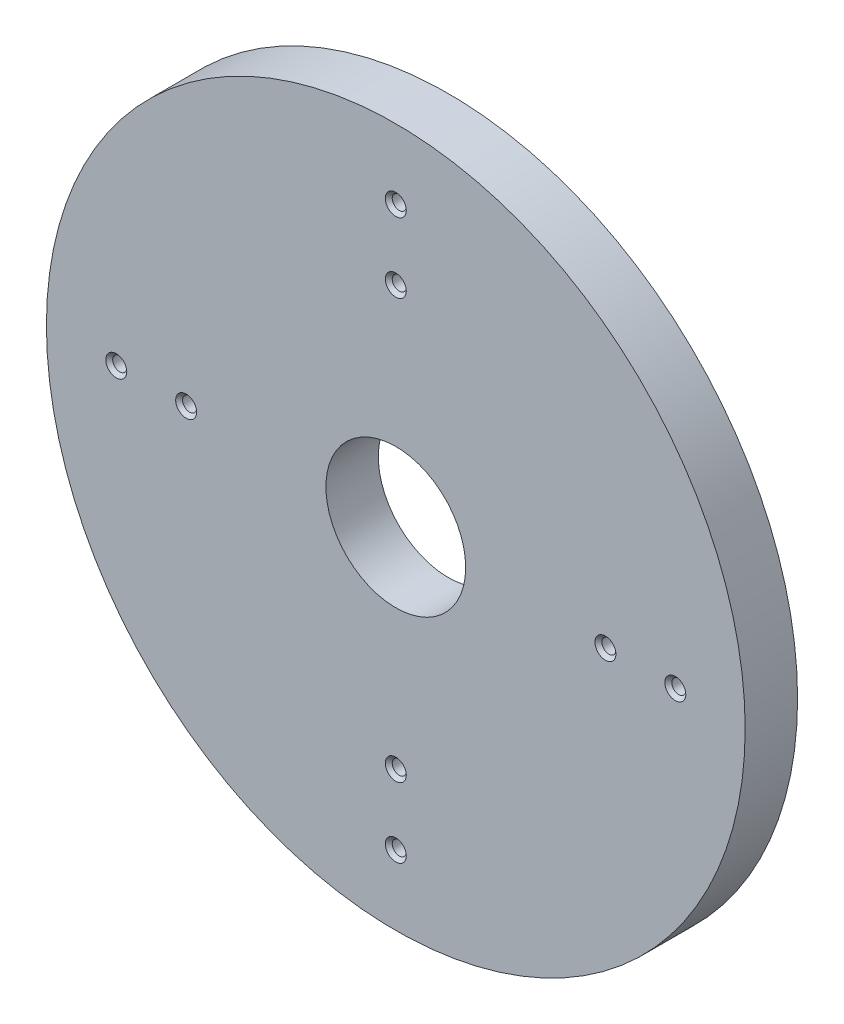
ISO-10303-21;
HEADER;
FILE_DESCRIPTION(('STEP AP214'),'2;1');
FILE_NAME('part.step','',(''),(''),'','','');
FILE_SCHEMA(('AUTOMOTIVE_DESIGN { 1 0 10303 214 1 1 1 1 }'));
ENDSEC;
DATA;
#1=APPLICATION_CONTEXT('core data for automotive mechanical design processes');
#2=APPLICATION_PROTOCOL_DEFINITION('international standard','automotive_design',2000,#1);
#3=PRODUCT_CONTEXT('',#1,'mechanical');
#4=PRODUCT('Part','Part','',(#3));
#5=PRODUCT_RELATED_PRODUCT_CATEGORY('part','',(#4));
#6=PRODUCT_DEFINITION_FORMATION('','',#4);
#7=PRODUCT_DEFINITION_CONTEXT('part definition',#1,'design');
#8=PRODUCT_DEFINITION('design','',#6,#7);
#9=PRODUCT_DEFINITION_SHAPE('','',#8);
#10=(LENGTH_UNIT() NAMED_UNIT(*) SI_UNIT(.MILLI.,.METRE.));
#11=(NAMED_UNIT(*) PLANE_ANGLE_UNIT() SI_UNIT($,.RADIAN.));
#12=(NAMED_UNIT(*) SI_UNIT($,.STERADIAN.) SOLID_ANGLE_UNIT());
#13=UNCERTAINTY_MEASURE_WITH_UNIT(LENGTH_MEASURE(1.E-05),#10,'distance_accuracy_value','');
#14=(GEOMETRIC_REPRESENTATION_CONTEXT(3) GLOBAL_UNCERTAINTY_ASSIGNED_CONTEXT((#13)) GLOBAL_UNIT_ASSIGNED_CONTEXT((#10,
#11,#12)) REPRESENTATION_CONTEXT('',''));
#15=CARTESIAN_POINT('',(0.,0.,0.));
#16=DIRECTION('',(0.,0.,1.));
#17=DIRECTION('',(1.,0.,0.));
#18=AXIS2_PLACEMENT_3D('',#15,#16,#17);
#19=CARTESIAN_POINT('',(0.,0.,19.05));
#20=DIRECTION('',(0.,0.,-1.));
#21=DIRECTION('',(-1.,0.,0.));
#22=AXIS2_PLACEMENT_3D('',#19,#20,#21);
#23=CYLINDRICAL_SURFACE('',#22,25.4);
#24=CARTESIAN_POINT('',(0.,0.,19.05));
#25=DIRECTION('',(0.,0.,1.));
#26=DIRECTION('',(1.,0.,0.));
#27=AXIS2_PLACEMENT_3D('',#24,#25,#26);
#28=CIRCLE('',#27,25.4);
#29=CARTESIAN_POINT('',(25.4,0.,19.05));
#30=VERTEX_POINT('',#29);
#31=EDGE_CURVE('E43',#30,#30,#28,.T.);
#32=ORIENTED_EDGE('',*,*,#31,.T.);
#33=EDGE_LOOP('',(#32));
#34=FACE_BOUND('',#33,.T.);
#35=CARTESIAN_POINT('',(0.,0.,0.));
#36=DIRECTION('',(0.,0.,1.));
#37=DIRECTION('',(1.,0.,0.));
#38=AXIS2_PLACEMENT_3D('',#35,#36,#37);
#39=CIRCLE('',#38,25.4);
#40=CARTESIAN_POINT('',(25.4,0.,0.));
#41=VERTEX_POINT('',#40);
#42=EDGE_CURVE('E50',#41,#41,#39,.T.);
#43=ORIENTED_EDGE('',*,*,#42,.F.);
#44=EDGE_LOOP('',(#43));
#45=FACE_BOUND('',#44,.T.);
#46=ADVANCED_FACE('F36',(#34,#45),#23,.F.);
#47=CARTESIAN_POINT('',(0.,0.,19.05));
#48=DIRECTION('',(0.,0.,-1.));
#49=DIRECTION('',(-1.,0.,0.));
#50=AXIS2_PLACEMENT_3D('',#47,#48,#49);
#51=CYLINDRICAL_SURFACE('',#50,127.);
#52=CARTESIAN_POINT('',(0.,0.,19.05));
#53=DIRECTION('',(0.,0.,1.));
#54=DIRECTION('',(1.,0.,0.));
#55=AXIS2_PLACEMENT_3D('',#52,#53,#54);
#56=CIRCLE('',#55,127.);
#57=CARTESIAN_POINT('',(127.,0.,19.05));
#58=VERTEX_POINT('',#57);
#59=EDGE_CURVE('E10',#58,#58,#56,.T.);
#60=ORIENTED_EDGE('',*,*,#59,.F.);
#61=EDGE_LOOP('',(#60));
#62=FACE_BOUND('',#61,.T.);
#63=CARTESIAN_POINT('',(0.,0.,0.));
#64=DIRECTION('',(0.,0.,1.));
#65=DIRECTION('',(1.,0.,0.));
#66=AXIS2_PLACEMENT_3D('',#63,#64,#65);
#67=CIRCLE('',#66,127.);
#68=CARTESIAN_POINT('',(127.,0.,0.));
#69=VERTEX_POINT('',#68);
#70=EDGE_CURVE('E39',#69,#69,#67,.T.);
#71=ORIENTED_EDGE('',*,*,#70,.T.);
#72=EDGE_LOOP('',(#71));
#73=FACE_BOUND('',#72,.T.);
#74=ADVANCED_FACE('F179',(#62,#73),#51,.T.);
#75=CARTESIAN_POINT('',(0.,0.,19.05));
#76=DIRECTION('',(0.,0.,1.));
#77=DIRECTION('',(1.,0.,0.));
#78=AXIS2_PLACEMENT_3D('',#75,#76,#77);
#79=PLANE('',#78);
#80=CARTESIAN_POINT('',(0.,101.6,19.05));
#81=DIRECTION('',(0.,0.,1.));
#82=DIRECTION('',(1.,0.,0.));
#83=AXIS2_PLACEMENT_3D('',#80,#81,#82);
#84=CIRCLE('',#83,3.81);
#85=CARTESIAN_POINT('',(3.81,101.6,19.05));
#86=VERTEX_POINT('',#85);
#87=EDGE_CURVE('E147',#86,#86,#84,.T.);
#88=ORIENTED_EDGE('',*,*,#87,.F.);
#89=EDGE_LOOP('',(#88));
#90=FACE_BOUND('',#89,.T.);
#91=CARTESIAN_POINT('',(0.,76.2,19.05));
#92=DIRECTION('',(0.,0.,1.));
#93=DIRECTION('',(1.,0.,0.));
#94=AXIS2_PLACEMENT_3D('',#91,#92,#93);
#95=CIRCLE('',#94,3.81);
#96=CARTESIAN_POINT('',(3.81,76.2,19.05));
#97=VERTEX_POINT('',#96);
#98=EDGE_CURVE('E135',#97,#97,#95,.T.);
#99=ORIENTED_EDGE('',*,*,#98,.F.);
#100=EDGE_LOOP('',(#99));
#101=FACE_BOUND('',#100,.T.);
#102=CARTESIAN_POINT('',(101.6,0.,19.05));
#103=DIRECTION('',(0.,0.,1.));
#104=DIRECTION('',(1.,0.,0.));
#105=AXIS2_PLACEMENT_3D('',#102,#103,#104);
#106=CIRCLE('',#105,3.80999999999999);
#107=CARTESIAN_POINT('',(105.41,0.,19.05));
#108=VERTEX_POINT('',#107);
#109=EDGE_CURVE('E123',#108,#108,#106,.T.);
#110=ORIENTED_EDGE('',*,*,#109,.F.);
#111=EDGE_LOOP('',(#110));
#112=FACE_BOUND('',#111,.T.);
#113=CARTESIAN_POINT('',(76.2,0.,19.05));
#114=DIRECTION('',(0.,0.,1.));
#115=DIRECTION('',(1.,0.,0.));
#116=AXIS2_PLACEMENT_3D('',#113,#114,#115);
#117=CIRCLE('',#116,3.80999999999999);
#118=CARTESIAN_POINT('',(80.01,0.,19.05));
#119=VERTEX_POINT('',#118);
#120=EDGE_CURVE('E111',#119,#119,#117,.T.);
#121=ORIENTED_EDGE('',*,*,#120,.F.);
#122=EDGE_LOOP('',(#121));
#123=FACE_BOUND('',#122,.T.);
#124=CARTESIAN_POINT('',(0.,-101.6,19.05));
#125=DIRECTION('',(0.,0.,1.));
#126=DIRECTION('',(1.,0.,0.));
#127=AXIS2_PLACEMENT_3D('',#124,#125,#126);
#128=CIRCLE('',#127,3.81);
#129=CARTESIAN_POINT('',(3.81,-101.6,19.05));
#130=VERTEX_POINT('',#129);
#131=EDGE_CURVE('E99',#130,#130,#128,.T.);
#132=ORIENTED_EDGE('',*,*,#131,.F.);
#133=EDGE_LOOP('',(#132));
#134=FACE_BOUND('',#133,.T.);
#135=CARTESIAN_POINT('',(0.,-76.2,19.05));
#136=DIRECTION('',(0.,0.,1.));
#137=DIRECTION('',(1.,0.,0.));
#138=AXIS2_PLACEMENT_3D('',#135,#136,#137);
#139=CIRCLE('',#138,3.81);
#140=CARTESIAN_POINT('',(3.80999999999998,-76.2,19.05));
#141=VERTEX_POINT('',#140);
#142=EDGE_CURVE('E87',#141,#141,#139,.T.);
#143=ORIENTED_EDGE('',*,*,#142,.F.);
#144=EDGE_LOOP('',(#143));
#145=FACE_BOUND('',#144,.T.);
#146=CARTESIAN_POINT('',(-101.6,0.,19.05));
#147=DIRECTION('',(0.,0.,1.));
#148=DIRECTION('',(1.,0.,0.));
#149=AXIS2_PLACEMENT_3D('',#146,#147,#148);
#150=CIRCLE('',#149,3.80999999999999);
#151=CARTESIAN_POINT('',(-97.79,0.,19.05));
#152=VERTEX_POINT('',#151);
#153=EDGE_CURVE('E75',#152,#152,#150,.T.);
#154=ORIENTED_EDGE('',*,*,#153,.F.);
#155=EDGE_LOOP('',(#154));
#156=FACE_BOUND('',#155,.T.);
#157=CARTESIAN_POINT('',(-76.2,0.,19.05));
#158=DIRECTION('',(0.,0.,1.));
#159=DIRECTION('',(1.,0.,0.));
#160=AXIS2_PLACEMENT_3D('',#157,#158,#159);
#161=CIRCLE('',#160,3.80999999999999);
#162=CARTESIAN_POINT('',(-72.3900000000001,0.,19.05));
#163=VERTEX_POINT('',#162);
#164=EDGE_CURVE('E61',#163,#163,#161,.T.);
#165=ORIENTED_EDGE('',*,*,#164,.F.);
#166=EDGE_LOOP('',(#165));
#167=FACE_BOUND('',#166,.T.);
#168=ORIENTED_EDGE('',*,*,#31,.F.);
#169=EDGE_LOOP('',(#168));
#170=FACE_BOUND('',#169,.T.);
#171=ORIENTED_EDGE('',*,*,#59,.T.);
#172=EDGE_LOOP('',(#171));
#173=FACE_BOUND('',#172,.T.);
#174=ADVANCED_FACE('F176',(#90,#101,#112,#123,#134,#145,#156,#167,#170,#173),#79,.T.);
#175=CARTESIAN_POINT('',(0.,0.,0.));
#176=DIRECTION('',(0.,0.,1.));
#177=DIRECTION('',(1.,0.,0.));
#178=AXIS2_PLACEMENT_3D('',#175,#176,#177);
#179=PLANE('',#178);
#180=CARTESIAN_POINT('',(0.,101.6,0.));
#181=DIRECTION('',(0.,0.,1.));
#182=DIRECTION('',(1.,0.,0.));
#183=AXIS2_PLACEMENT_3D('',#180,#181,#182);
#184=CIRCLE('',#183,3.81);
#185=CARTESIAN_POINT('',(3.81,101.6,0.));
#186=VERTEX_POINT('',#185);
#187=EDGE_CURVE('E150',#186,#186,#184,.T.);
#188=ORIENTED_EDGE('',*,*,#187,.T.);
#189=EDGE_LOOP('',(#188));
#190=FACE_BOUND('',#189,.T.);
#191=CARTESIAN_POINT('',(0.,76.2,0.));
#192=DIRECTION('',(0.,0.,1.));
#193=DIRECTION('',(1.,0.,0.));
#194=AXIS2_PLACEMENT_3D('',#191,#192,#193);
#195=CIRCLE('',#194,3.81);
#196=CARTESIAN_POINT('',(3.81,76.2,0.));
#197=VERTEX_POINT('',#196);
#198=EDGE_CURVE('E138',#197,#197,#195,.T.);
#199=ORIENTED_EDGE('',*,*,#198,.T.);
#200=EDGE_LOOP('',(#199));
#201=FACE_BOUND('',#200,.T.);
#202=CARTESIAN_POINT('',(101.6,0.,0.));
#203=DIRECTION('',(0.,0.,1.));
#204=DIRECTION('',(1.,0.,0.));
#205=AXIS2_PLACEMENT_3D('',#202,#203,#204);
#206=CIRCLE('',#205,3.80999999999999);
#207=CARTESIAN_POINT('',(105.41,0.,0.));
#208=VERTEX_POINT('',#207);
#209=EDGE_CURVE('E126',#208,#208,#206,.T.);
#210=ORIENTED_EDGE('',*,*,#209,.T.);
#211=EDGE_LOOP('',(#210));
#212=FACE_BOUND('',#211,.T.);
#213=CARTESIAN_POINT('',(76.2,0.,0.));
#214=DIRECTION('',(0.,0.,1.));
#215=DIRECTION('',(1.,0.,0.));
#216=AXIS2_PLACEMENT_3D('',#213,#214,#215);
#217=CIRCLE('',#216,3.80999999999999);
#218=CARTESIAN_POINT('',(80.01,0.,0.));
#219=VERTEX_POINT('',#218);
#220=EDGE_CURVE('E114',#219,#219,#217,.T.);
#221=ORIENTED_EDGE('',*,*,#220,.T.);
#222=EDGE_LOOP('',(#221));
#223=FACE_BOUND('',#222,.T.);
#224=CARTESIAN_POINT('',(0.,-101.6,0.));
#225=DIRECTION('',(0.,0.,1.));
#226=DIRECTION('',(1.,0.,0.));
#227=AXIS2_PLACEMENT_3D('',#224,#225,#226);
#228=CIRCLE('',#227,3.81);
#229=CARTESIAN_POINT('',(3.81,-101.6,0.));
#230=VERTEX_POINT('',#229);
#231=EDGE_CURVE('E102',#230,#230,#228,.T.);
#232=ORIENTED_EDGE('',*,*,#231,.T.);
#233=EDGE_LOOP('',(#232));
#234=FACE_BOUND('',#233,.T.);
#235=CARTESIAN_POINT('',(0.,-76.2,0.));
#236=DIRECTION('',(0.,0.,1.));
#237=DIRECTION('',(1.,0.,0.));
#238=AXIS2_PLACEMENT_3D('',#235,#236,#237);
#239=CIRCLE('',#238,3.81);
#240=CARTESIAN_POINT('',(3.80999999999998,-76.2,0.));
#241=VERTEX_POINT('',#240);
#242=EDGE_CURVE('E90',#241,#241,#239,.T.);
#243=ORIENTED_EDGE('',*,*,#242,.T.);
#244=EDGE_LOOP('',(#243));
#245=FACE_BOUND('',#244,.T.);
#246=CARTESIAN_POINT('',(-101.6,0.,0.));
#247=DIRECTION('',(0.,0.,1.));
#248=DIRECTION('',(1.,0.,0.));
#249=AXIS2_PLACEMENT_3D('',#246,#247,#248);
#250=CIRCLE('',#249,3.80999999999999);
#251=CARTESIAN_POINT('',(-97.79,0.,0.));
#252=VERTEX_POINT('',#251);
#253=EDGE_CURVE('E78',#252,#252,#250,.T.);
#254=ORIENTED_EDGE('',*,*,#253,.T.);
#255=EDGE_LOOP('',(#254));
#256=FACE_BOUND('',#255,.T.);
#257=CARTESIAN_POINT('',(-76.2,0.,0.));
#258=DIRECTION('',(0.,0.,1.));
#259=DIRECTION('',(1.,0.,0.));
#260=AXIS2_PLACEMENT_3D('',#257,#258,#259);
#261=CIRCLE('',#260,3.80999999999999);
#262=CARTESIAN_POINT('',(-72.3900000000001,0.,0.));
#263=VERTEX_POINT('',#262);
#264=EDGE_CURVE('E66',#263,#263,#261,.T.);
#265=ORIENTED_EDGE('',*,*,#264,.T.);
#266=EDGE_LOOP('',(#265));
#267=FACE_BOUND('',#266,.T.);
#268=ORIENTED_EDGE('',*,*,#42,.T.);
#269=EDGE_LOOP('',(#268));
#270=FACE_BOUND('',#269,.T.);
#271=ORIENTED_EDGE('',*,*,#70,.F.);
#272=EDGE_LOOP('',(#271));
#273=FACE_BOUND('',#272,.T.);
#274=ADVANCED_FACE('F154',(#190,#201,#212,#223,#234,#245,#256,#267,#270,#273),#179,.F.);
#275=CARTESIAN_POINT('',(-76.2,0.,1.2573));
#276=DIRECTION('',(0.,0.,-1.));
#277=DIRECTION('',(-1.,0.,0.));
#278=AXIS2_PLACEMENT_3D('',#275,#276,#277);
#279=CONICAL_SURFACE('',#278,2.55269999999999,0.78539816339745);
#280=ORIENTED_EDGE('',*,*,#264,.F.);
#281=EDGE_LOOP('',(#280));
#282=FACE_BOUND('',#281,.T.);
#283=CARTESIAN_POINT('',(-76.2,0.,1.2573));
#284=DIRECTION('',(0.,0.,1.));
#285=DIRECTION('',(1.,0.,0.));
#286=AXIS2_PLACEMENT_3D('',#283,#284,#285);
#287=CIRCLE('',#286,2.55269999999999);
#288=CARTESIAN_POINT('',(-73.6473000000001,0.,1.2573));
#289=VERTEX_POINT('',#288);
#290=EDGE_CURVE('E52',#289,#289,#287,.T.);
#291=ORIENTED_EDGE('',*,*,#290,.T.);
#292=EDGE_LOOP('',(#291));
#293=FACE_BOUND('',#292,.T.);
#294=ADVANCED_FACE('F208',(#282,#293),#279,.F.);
#295=CARTESIAN_POINT('',(-76.2,0.,19.05));
#296=DIRECTION('',(0.,0.,1.));
#297=DIRECTION('',(1.,0.,0.));
#298=AXIS2_PLACEMENT_3D('',#295,#296,#297);
#299=CYLINDRICAL_SURFACE('',#298,2.55269999999999);
#300=ORIENTED_EDGE('',*,*,#290,.F.);
#301=EDGE_LOOP('',(#300));
#302=FACE_BOUND('',#301,.T.);
#303=CARTESIAN_POINT('',(-76.2,0.,17.7927));
#304=DIRECTION('',(0.,0.,1.));
#305=DIRECTION('',(1.,0.,0.));
#306=AXIS2_PLACEMENT_3D('',#303,#304,#305);
#307=CIRCLE('',#306,2.55269999999999);
#308=CARTESIAN_POINT('',(-73.6473000000001,0.,17.7927));
#309=VERTEX_POINT('',#308);
#310=EDGE_CURVE('E57',#309,#309,#307,.T.);
#311=ORIENTED_EDGE('',*,*,#310,.T.);
#312=EDGE_LOOP('',(#311));
#313=FACE_BOUND('',#312,.T.);
#314=ADVANCED_FACE('F212',(#302,#313),#299,.F.);
#315=CARTESIAN_POINT('',(-76.2,0.,19.05));
#316=DIRECTION('',(0.,0.,1.));
#317=DIRECTION('',(1.,0.,0.));
#318=AXIS2_PLACEMENT_3D('',#315,#316,#317);
#319=CONICAL_SURFACE('',#318,3.80999999999999,0.785398163397448);
#320=ORIENTED_EDGE('',*,*,#310,.F.);
#321=EDGE_LOOP('',(#320));
#322=FACE_BOUND('',#321,.T.);
#323=ORIENTED_EDGE('',*,*,#164,.T.);
#324=EDGE_LOOP('',(#323));
#325=FACE_BOUND('',#324,.T.);
#326=ADVANCED_FACE('F216',(#322,#325),#319,.F.);
#327=CARTESIAN_POINT('',(-101.6,0.,1.2573));
#328=DIRECTION('',(0.,0.,-1.));
#329=DIRECTION('',(-1.,0.,0.));
#330=AXIS2_PLACEMENT_3D('',#327,#328,#329);
#331=CONICAL_SURFACE('',#330,2.55269999999999,0.78539816339745);
#332=ORIENTED_EDGE('',*,*,#253,.F.);
#333=EDGE_LOOP('',(#332));
#334=FACE_BOUND('',#333,.T.);
#335=CARTESIAN_POINT('',(-101.6,0.,1.2573));
#336=DIRECTION('',(0.,0.,1.));
#337=DIRECTION('',(1.,0.,0.));
#338=AXIS2_PLACEMENT_3D('',#335,#336,#337);
#339=CIRCLE('',#338,2.55269999999999);
#340=CARTESIAN_POINT('',(-99.0473,0.,1.2573));
#341=VERTEX_POINT('',#340);
#342=EDGE_CURVE('E69',#341,#341,#339,.T.);
#343=ORIENTED_EDGE('',*,*,#342,.T.);
#344=EDGE_LOOP('',(#343));
#345=FACE_BOUND('',#344,.T.);
#346=ADVANCED_FACE('F220',(#334,#345),#331,.F.);
#347=CARTESIAN_POINT('',(-101.6,0.,19.05));
#348=DIRECTION('',(0.,0.,1.));
#349=DIRECTION('',(1.,0.,0.));
#350=AXIS2_PLACEMENT_3D('',#347,#348,#349);
#351=CYLINDRICAL_SURFACE('',#350,2.55269999999999);
#352=ORIENTED_EDGE('',*,*,#342,.F.);
#353=EDGE_LOOP('',(#352));
#354=FACE_BOUND('',#353,.T.);
#355=CARTESIAN_POINT('',(-101.6,0.,17.7927));
#356=DIRECTION('',(0.,0.,1.));
#357=DIRECTION('',(1.,0.,0.));
#358=AXIS2_PLACEMENT_3D('',#355,#356,#357);
#359=CIRCLE('',#358,2.55269999999999);
#360=CARTESIAN_POINT('',(-99.0473,0.,17.7927));
#361=VERTEX_POINT('',#360);
#362=EDGE_CURVE('E72',#361,#361,#359,.T.);
#363=ORIENTED_EDGE('',*,*,#362,.T.);
#364=EDGE_LOOP('',(#363));
#365=FACE_BOUND('',#364,.T.);
#366=ADVANCED_FACE('F224',(#354,#365),#351,.F.);
#367=CARTESIAN_POINT('',(-101.6,0.,19.05));
#368=DIRECTION('',(0.,0.,1.));
#369=DIRECTION('',(1.,0.,0.));
#370=AXIS2_PLACEMENT_3D('',#367,#368,#369);
#371=CONICAL_SURFACE('',#370,3.80999999999999,0.785398163397448);
#372=ORIENTED_EDGE('',*,*,#362,.F.);
#373=EDGE_LOOP('',(#372));
#374=FACE_BOUND('',#373,.T.);
#375=ORIENTED_EDGE('',*,*,#153,.T.);
#376=EDGE_LOOP('',(#375));
#377=FACE_BOUND('',#376,.T.);
#378=ADVANCED_FACE('F228',(#374,#377),#371,.F.);
#379=CARTESIAN_POINT('',(0.,-76.2,1.2573));
#380=DIRECTION('',(0.,0.,-1.));
#381=DIRECTION('',(-1.,0.,0.));
#382=AXIS2_PLACEMENT_3D('',#379,#380,#381);
#383=CONICAL_SURFACE('',#382,2.5527,0.785398163397449);
#384=ORIENTED_EDGE('',*,*,#242,.F.);
#385=EDGE_LOOP('',(#384));
#386=FACE_BOUND('',#385,.T.);
#387=CARTESIAN_POINT('',(0.,-76.2,1.2573));
#388=DIRECTION('',(0.,0.,1.));
#389=DIRECTION('',(1.,0.,0.));
#390=AXIS2_PLACEMENT_3D('',#387,#388,#389);
#391=CIRCLE('',#390,2.5527);
#392=CARTESIAN_POINT('',(2.55269999999998,-76.2,1.2573));
#393=VERTEX_POINT('',#392);
#394=EDGE_CURVE('E81',#393,#393,#391,.T.);
#395=ORIENTED_EDGE('',*,*,#394,.T.);
#396=EDGE_LOOP('',(#395));
#397=FACE_BOUND('',#396,.T.);
#398=ADVANCED_FACE('F232',(#386,#397),#383,.F.);
#399=CARTESIAN_POINT('',(0.,-76.2,19.05));
#400=DIRECTION('',(0.,0.,1.));
#401=DIRECTION('',(1.,0.,0.));
#402=AXIS2_PLACEMENT_3D('',#399,#400,#401);
#403=CYLINDRICAL_SURFACE('',#402,2.5527);
#404=ORIENTED_EDGE('',*,*,#394,.F.);
#405=EDGE_LOOP('',(#404));
#406=FACE_BOUND('',#405,.T.);
#407=CARTESIAN_POINT('',(0.,-76.2,17.7927));
#408=DIRECTION('',(0.,0.,1.));
#409=DIRECTION('',(1.,0.,0.));
#410=AXIS2_PLACEMENT_3D('',#407,#408,#409);
#411=CIRCLE('',#410,2.5527);
#412=CARTESIAN_POINT('',(2.55269999999998,-76.2,17.7927));
#413=VERTEX_POINT('',#412);
#414=EDGE_CURVE('E84',#413,#413,#411,.T.);
#415=ORIENTED_EDGE('',*,*,#414,.T.);
#416=EDGE_LOOP('',(#415));
#417=FACE_BOUND('',#416,.T.);
#418=ADVANCED_FACE('F236',(#406,#417),#403,.F.);
#419=CARTESIAN_POINT('',(0.,-76.2,19.05));
#420=DIRECTION('',(0.,0.,1.));
#421=DIRECTION('',(1.,0.,0.));
#422=AXIS2_PLACEMENT_3D('',#419,#420,#421);
#423=CONICAL_SURFACE('',#422,3.81,0.785398163397448);
#424=ORIENTED_EDGE('',*,*,#414,.F.);
#425=EDGE_LOOP('',(#424));
#426=FACE_BOUND('',#425,.T.);
#427=ORIENTED_EDGE('',*,*,#142,.T.);
#428=EDGE_LOOP('',(#427));
#429=FACE_BOUND('',#428,.T.);
#430=ADVANCED_FACE('F240',(#426,#429),#423,.F.);
#431=CARTESIAN_POINT('',(0.,-101.6,1.2573));
#432=DIRECTION('',(0.,0.,-1.));
#433=DIRECTION('',(-1.,0.,0.));
#434=AXIS2_PLACEMENT_3D('',#431,#432,#433);
#435=CONICAL_SURFACE('',#434,2.5527,0.785398163397449);
#436=ORIENTED_EDGE('',*,*,#231,.F.);
#437=EDGE_LOOP('',(#436));
#438=FACE_BOUND('',#437,.T.);
#439=CARTESIAN_POINT('',(0.,-101.6,1.2573));
#440=DIRECTION('',(0.,0.,1.));
#441=DIRECTION('',(1.,0.,0.));
#442=AXIS2_PLACEMENT_3D('',#439,#440,#441);
#443=CIRCLE('',#442,2.5527);
#444=CARTESIAN_POINT('',(2.5527,-101.6,1.2573));
#445=VERTEX_POINT('',#444);
#446=EDGE_CURVE('E93',#445,#445,#443,.T.);
#447=ORIENTED_EDGE('',*,*,#446,.T.);
#448=EDGE_LOOP('',(#447));
#449=FACE_BOUND('',#448,.T.);
#450=ADVANCED_FACE('F244',(#438,#449),#435,.F.);
#451=CARTESIAN_POINT('',(0.,-101.6,19.05));
#452=DIRECTION('',(0.,0.,1.));
#453=DIRECTION('',(1.,0.,0.));
#454=AXIS2_PLACEMENT_3D('',#451,#452,#453);
#455=CYLINDRICAL_SURFACE('',#454,2.5527);
#456=ORIENTED_EDGE('',*,*,#446,.F.);
#457=EDGE_LOOP('',(#456));
#458=FACE_BOUND('',#457,.T.);
#459=CARTESIAN_POINT('',(0.,-101.6,17.7927));
#460=DIRECTION('',(0.,0.,1.));
#461=DIRECTION('',(1.,0.,0.));
#462=AXIS2_PLACEMENT_3D('',#459,#460,#461);
#463=CIRCLE('',#462,2.5527);
#464=CARTESIAN_POINT('',(2.5527,-101.6,17.7927));
#465=VERTEX_POINT('',#464);
#466=EDGE_CURVE('E96',#465,#465,#463,.T.);
#467=ORIENTED_EDGE('',*,*,#466,.T.);
#468=EDGE_LOOP('',(#467));
#469=FACE_BOUND('',#468,.T.);
#470=ADVANCED_FACE('F248',(#458,#469),#455,.F.);
#471=CARTESIAN_POINT('',(0.,-101.6,19.05));
#472=DIRECTION('',(0.,0.,1.));
#473=DIRECTION('',(1.,0.,0.));
#474=AXIS2_PLACEMENT_3D('',#471,#472,#473);
#475=CONICAL_SURFACE('',#474,3.81,0.785398163397448);
#476=ORIENTED_EDGE('',*,*,#466,.F.);
#477=EDGE_LOOP('',(#476));
#478=FACE_BOUND('',#477,.T.);
#479=ORIENTED_EDGE('',*,*,#131,.T.);
#480=EDGE_LOOP('',(#479));
#481=FACE_BOUND('',#480,.T.);
#482=ADVANCED_FACE('F252',(#478,#481),#475,.F.);
#483=CARTESIAN_POINT('',(76.2,0.,1.2573));
#484=DIRECTION('',(0.,0.,-1.));
#485=DIRECTION('',(-1.,0.,0.));
#486=AXIS2_PLACEMENT_3D('',#483,#484,#485);
#487=CONICAL_SURFACE('',#486,2.55269999999999,0.78539816339745);
#488=ORIENTED_EDGE('',*,*,#220,.F.);
#489=EDGE_LOOP('',(#488));
#490=FACE_BOUND('',#489,.T.);
#491=CARTESIAN_POINT('',(76.2,0.,1.2573));
#492=DIRECTION('',(0.,0.,1.));
#493=DIRECTION('',(1.,0.,0.));
#494=AXIS2_PLACEMENT_3D('',#491,#492,#493);
#495=CIRCLE('',#494,2.55269999999999);
#496=CARTESIAN_POINT('',(78.7527,0.,1.2573));
#497=VERTEX_POINT('',#496);
#498=EDGE_CURVE('E105',#497,#497,#495,.T.);
#499=ORIENTED_EDGE('',*,*,#498,.T.);
#500=EDGE_LOOP('',(#499));
#501=FACE_BOUND('',#500,.T.);
#502=ADVANCED_FACE('F256',(#490,#501),#487,.F.);
#503=CARTESIAN_POINT('',(76.2,0.,19.05));
#504=DIRECTION('',(0.,0.,1.));
#505=DIRECTION('',(1.,0.,0.));
#506=AXIS2_PLACEMENT_3D('',#503,#504,#505);
#507=CYLINDRICAL_SURFACE('',#506,2.55269999999999);
#508=ORIENTED_EDGE('',*,*,#498,.F.);
#509=EDGE_LOOP('',(#508));
#510=FACE_BOUND('',#509,.T.);
#511=CARTESIAN_POINT('',(76.2,0.,17.7927));
#512=DIRECTION('',(0.,0.,1.));
#513=DIRECTION('',(1.,0.,0.));
#514=AXIS2_PLACEMENT_3D('',#511,#512,#513);
#515=CIRCLE('',#514,2.55269999999999);
#516=CARTESIAN_POINT('',(78.7527,0.,17.7927));
#517=VERTEX_POINT('',#516);
#518=EDGE_CURVE('E108',#517,#517,#515,.T.);
#519=ORIENTED_EDGE('',*,*,#518,.T.);
#520=EDGE_LOOP('',(#519));
#521=FACE_BOUND('',#520,.T.);
#522=ADVANCED_FACE('F260',(#510,#521),#507,.F.);
#523=CARTESIAN_POINT('',(76.2,0.,19.05));
#524=DIRECTION('',(0.,0.,1.));
#525=DIRECTION('',(1.,0.,0.));
#526=AXIS2_PLACEMENT_3D('',#523,#524,#525);
#527=CONICAL_SURFACE('',#526,3.80999999999999,0.785398163397448);
#528=ORIENTED_EDGE('',*,*,#518,.F.);
#529=EDGE_LOOP('',(#528));
#530=FACE_BOUND('',#529,.T.);
#531=ORIENTED_EDGE('',*,*,#120,.T.);
#532=EDGE_LOOP('',(#531));
#533=FACE_BOUND('',#532,.T.);
#534=ADVANCED_FACE('F264',(#530,#533),#527,.F.);
#535=CARTESIAN_POINT('',(101.6,0.,1.2573));
#536=DIRECTION('',(0.,0.,-1.));
#537=DIRECTION('',(-1.,0.,0.));
#538=AXIS2_PLACEMENT_3D('',#535,#536,#537);
#539=CONICAL_SURFACE('',#538,2.55269999999999,0.78539816339745);
#540=ORIENTED_EDGE('',*,*,#209,.F.);
#541=EDGE_LOOP('',(#540));
#542=FACE_BOUND('',#541,.T.);
#543=CARTESIAN_POINT('',(101.6,0.,1.2573));
#544=DIRECTION('',(0.,0.,1.));
#545=DIRECTION('',(1.,0.,0.));
#546=AXIS2_PLACEMENT_3D('',#543,#544,#545);
#547=CIRCLE('',#546,2.55269999999999);
#548=CARTESIAN_POINT('',(104.1527,0.,1.2573));
#549=VERTEX_POINT('',#548);
#550=EDGE_CURVE('E117',#549,#549,#547,.T.);
#551=ORIENTED_EDGE('',*,*,#550,.T.);
#552=EDGE_LOOP('',(#551));
#553=FACE_BOUND('',#552,.T.);
#554=ADVANCED_FACE('F268',(#542,#553),#539,.F.);
#555=CARTESIAN_POINT('',(101.6,0.,19.05));
#556=DIRECTION('',(0.,0.,1.));
#557=DIRECTION('',(1.,0.,0.));
#558=AXIS2_PLACEMENT_3D('',#555,#556,#557);
#559=CYLINDRICAL_SURFACE('',#558,2.55269999999999);
#560=ORIENTED_EDGE('',*,*,#550,.F.);
#561=EDGE_LOOP('',(#560));
#562=FACE_BOUND('',#561,.T.);
#563=CARTESIAN_POINT('',(101.6,0.,17.7927));
#564=DIRECTION('',(0.,0.,1.));
#565=DIRECTION('',(1.,0.,0.));
#566=AXIS2_PLACEMENT_3D('',#563,#564,#565);
#567=CIRCLE('',#566,2.55269999999999);
#568=CARTESIAN_POINT('',(104.1527,0.,17.7927));
#569=VERTEX_POINT('',#568);
#570=EDGE_CURVE('E120',#569,#569,#567,.T.);
#571=ORIENTED_EDGE('',*,*,#570,.T.);
#572=EDGE_LOOP('',(#571));
#573=FACE_BOUND('',#572,.T.);
#574=ADVANCED_FACE('F272',(#562,#573),#559,.F.);
#575=CARTESIAN_POINT('',(101.6,0.,19.05));
#576=DIRECTION('',(0.,0.,1.));
#577=DIRECTION('',(1.,0.,0.));
#578=AXIS2_PLACEMENT_3D('',#575,#576,#577);
#579=CONICAL_SURFACE('',#578,3.80999999999999,0.785398163397448);
#580=ORIENTED_EDGE('',*,*,#570,.F.);
#581=EDGE_LOOP('',(#580));
#582=FACE_BOUND('',#581,.T.);
#583=ORIENTED_EDGE('',*,*,#109,.T.);
#584=EDGE_LOOP('',(#583));
#585=FACE_BOUND('',#584,.T.);
#586=ADVANCED_FACE('F276',(#582,#585),#579,.F.);
#587=CARTESIAN_POINT('',(0.,76.2,1.2573));
#588=DIRECTION('',(0.,0.,-1.));
#589=DIRECTION('',(-1.,0.,0.));
#590=AXIS2_PLACEMENT_3D('',#587,#588,#589);
#591=CONICAL_SURFACE('',#590,2.5527,0.785398163397449);
#592=ORIENTED_EDGE('',*,*,#198,.F.);
#593=EDGE_LOOP('',(#592));
#594=FACE_BOUND('',#593,.T.);
#595=CARTESIAN_POINT('',(0.,76.2,1.2573));
#596=DIRECTION('',(0.,0.,1.));
#597=DIRECTION('',(1.,0.,0.));
#598=AXIS2_PLACEMENT_3D('',#595,#596,#597);
#599=CIRCLE('',#598,2.5527);
#600=CARTESIAN_POINT('',(2.5527,76.2,1.2573));
#601=VERTEX_POINT('',#600);
#602=EDGE_CURVE('E129',#601,#601,#599,.T.);
#603=ORIENTED_EDGE('',*,*,#602,.T.);
#604=EDGE_LOOP('',(#603));
#605=FACE_BOUND('',#604,.T.);
#606=ADVANCED_FACE('F280',(#594,#605),#591,.F.);
#607=CARTESIAN_POINT('',(0.,76.2,19.05));
#608=DIRECTION('',(0.,0.,1.));
#609=DIRECTION('',(1.,0.,0.));
#610=AXIS2_PLACEMENT_3D('',#607,#608,#609);
#611=CYLINDRICAL_SURFACE('',#610,2.5527);
#612=ORIENTED_EDGE('',*,*,#602,.F.);
#613=EDGE_LOOP('',(#612));
#614=FACE_BOUND('',#613,.T.);
#615=CARTESIAN_POINT('',(0.,76.2,17.7927));
#616=DIRECTION('',(0.,0.,1.));
#617=DIRECTION('',(1.,0.,0.));
#618=AXIS2_PLACEMENT_3D('',#615,#616,#617);
#619=CIRCLE('',#618,2.5527);
#620=CARTESIAN_POINT('',(2.5527,76.2,17.7927));
#621=VERTEX_POINT('',#620);
#622=EDGE_CURVE('E132',#621,#621,#619,.T.);
#623=ORIENTED_EDGE('',*,*,#622,.T.);
#624=EDGE_LOOP('',(#623));
#625=FACE_BOUND('',#624,.T.);
#626=ADVANCED_FACE('F284',(#614,#625),#611,.F.);
#627=CARTESIAN_POINT('',(0.,76.2,19.05));
#628=DIRECTION('',(0.,0.,1.));
#629=DIRECTION('',(1.,0.,0.));
#630=AXIS2_PLACEMENT_3D('',#627,#628,#629);
#631=CONICAL_SURFACE('',#630,3.81,0.785398163397448);
#632=ORIENTED_EDGE('',*,*,#622,.F.);
#633=EDGE_LOOP('',(#632));
#634=FACE_BOUND('',#633,.T.);
#635=ORIENTED_EDGE('',*,*,#98,.T.);
#636=EDGE_LOOP('',(#635));
#637=FACE_BOUND('',#636,.T.);
#638=ADVANCED_FACE('F161',(#634,#637),#631,.F.);
#639=CARTESIAN_POINT('',(0.,101.6,1.2573));
#640=DIRECTION('',(0.,0.,-1.));
#641=DIRECTION('',(-1.,0.,0.));
#642=AXIS2_PLACEMENT_3D('',#639,#640,#641);
#643=CONICAL_SURFACE('',#642,2.5527,0.785398163397449);
#644=ORIENTED_EDGE('',*,*,#187,.F.);
#645=EDGE_LOOP('',(#644));
#646=FACE_BOUND('',#645,.T.);
#647=CARTESIAN_POINT('',(0.,101.6,1.2573));
#648=DIRECTION('',(0.,0.,1.));
#649=DIRECTION('',(1.,0.,0.));
#650=AXIS2_PLACEMENT_3D('',#647,#648,#649);
#651=CIRCLE('',#650,2.5527);
#652=CARTESIAN_POINT('',(2.5527,101.6,1.2573));
#653=VERTEX_POINT('',#652);
#654=EDGE_CURVE('E141',#653,#653,#651,.T.);
#655=ORIENTED_EDGE('',*,*,#654,.T.);
#656=EDGE_LOOP('',(#655));
#657=FACE_BOUND('',#656,.T.);
#658=ADVANCED_FACE('F157',(#646,#657),#643,.F.);
#659=CARTESIAN_POINT('',(0.,101.6,19.05));
#660=DIRECTION('',(0.,0.,1.));
#661=DIRECTION('',(1.,0.,0.));
#662=AXIS2_PLACEMENT_3D('',#659,#660,#661);
#663=CYLINDRICAL_SURFACE('',#662,2.5527);
#664=ORIENTED_EDGE('',*,*,#654,.F.);
#665=EDGE_LOOP('',(#664));
#666=FACE_BOUND('',#665,.T.);
#667=CARTESIAN_POINT('',(0.,101.6,17.7927));
#668=DIRECTION('',(0.,0.,1.));
#669=DIRECTION('',(1.,0.,0.));
#670=AXIS2_PLACEMENT_3D('',#667,#668,#669);
#671=CIRCLE('',#670,2.5527);
#672=CARTESIAN_POINT('',(2.5527,101.6,17.7927));
#673=VERTEX_POINT('',#672);
#674=EDGE_CURVE('E144',#673,#673,#671,.T.);
#675=ORIENTED_EDGE('',*,*,#674,.T.);
#676=EDGE_LOOP('',(#675));
#677=FACE_BOUND('',#676,.T.);
#678=ADVANCED_FACE('F160',(#666,#677),#663,.F.);
#679=CARTESIAN_POINT('',(0.,101.6,19.05));
#680=DIRECTION('',(0.,0.,1.));
#681=DIRECTION('',(1.,0.,0.));
#682=AXIS2_PLACEMENT_3D('',#679,#680,#681);
#683=CONICAL_SURFACE('',#682,3.81,0.785398163397448);
#684=ORIENTED_EDGE('',*,*,#674,.F.);
#685=EDGE_LOOP('',(#684));
#686=FACE_BOUND('',#685,.T.);
#687=ORIENTED_EDGE('',*,*,#87,.T.);
#688=EDGE_LOOP('',(#687));
#689=FACE_BOUND('',#688,.T.);
#690=ADVANCED_FACE('F167',(#686,#689),#683,.F.);
#691=CLOSED_SHELL('',(#46,#74,#174,#274,#294,#314,#326,#346,#366,#378,#398,#418,#430,#450,#470,
#482,#502,#522,#534,#554,#574,#586,#606,#626,#638,#658,#678,#690));
#692=MANIFOLD_SOLID_BREP('B2',#691);
#693=ADVANCED_BREP_SHAPE_REPRESENTATION('',(#18,#692),#14);
#694=SHAPE_DEFINITION_REPRESENTATION(#9,#693);
ENDSEC;
END-ISO-10303-21;
